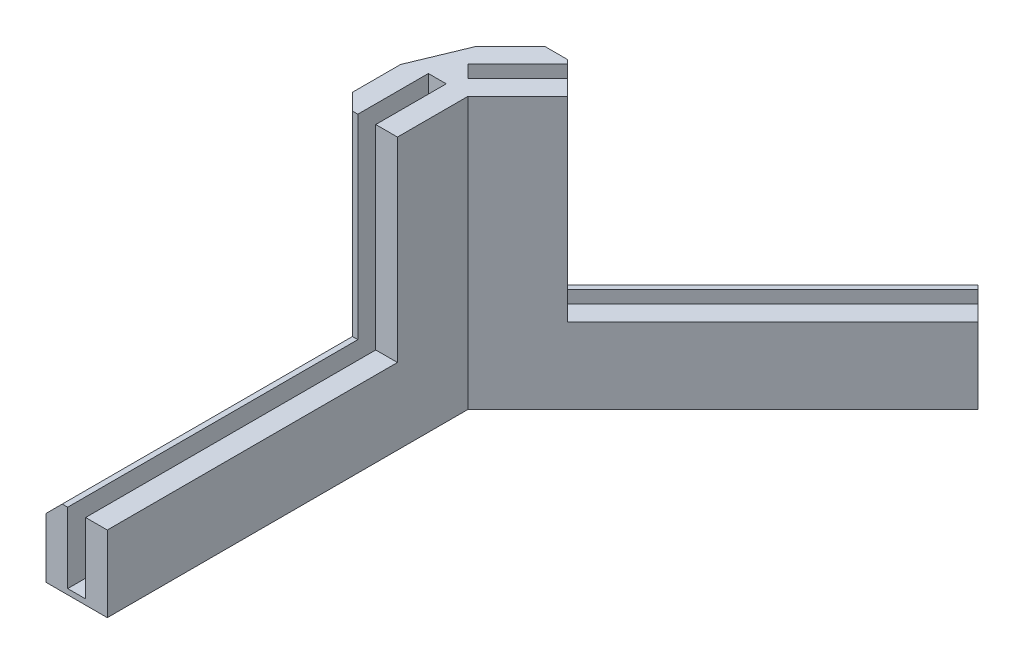
ISO-10303-21;
HEADER;
FILE_DESCRIPTION(('STEP AP214'),'2;1');
FILE_NAME('part.step','',(''),(''),'','','');
FILE_SCHEMA(('AUTOMOTIVE_DESIGN { 1 0 10303 214 1 1 1 1 }'));
ENDSEC;
DATA;
#1=APPLICATION_CONTEXT('core data for automotive mechanical design processes');
#2=APPLICATION_PROTOCOL_DEFINITION('international standard','automotive_design',2000,#1);
#3=PRODUCT_CONTEXT('',#1,'mechanical');
#4=PRODUCT('Part','Part','',(#3));
#5=PRODUCT_RELATED_PRODUCT_CATEGORY('part','',(#4));
#6=PRODUCT_DEFINITION_FORMATION('','',#4);
#7=PRODUCT_DEFINITION_CONTEXT('part definition',#1,'design');
#8=PRODUCT_DEFINITION('design','',#6,#7);
#9=PRODUCT_DEFINITION_SHAPE('','',#8);
#10=(LENGTH_UNIT() NAMED_UNIT(*) SI_UNIT(.MILLI.,.METRE.));
#11=(NAMED_UNIT(*) PLANE_ANGLE_UNIT() SI_UNIT($,.RADIAN.));
#12=(NAMED_UNIT(*) SI_UNIT($,.STERADIAN.) SOLID_ANGLE_UNIT());
#13=UNCERTAINTY_MEASURE_WITH_UNIT(LENGTH_MEASURE(1.E-05),#10,'distance_accuracy_value','');
#14=(GEOMETRIC_REPRESENTATION_CONTEXT(3) GLOBAL_UNCERTAINTY_ASSIGNED_CONTEXT((#13)) GLOBAL_UNIT_ASSIGNED_CONTEXT((#10,
#11,#12)) REPRESENTATION_CONTEXT('',''));
#15=CARTESIAN_POINT('',(0.,0.,0.));
#16=DIRECTION('',(0.,0.,1.));
#17=DIRECTION('',(1.,0.,0.));
#18=AXIS2_PLACEMENT_3D('',#15,#16,#17);
#19=CARTESIAN_POINT('',(-13.,50.,3.11837383565331));
#20=DIRECTION('',(0.923879869163213,0.,0.382682619614433));
#21=DIRECTION('',(0.,-1.,0.));
#22=AXIS2_PLACEMENT_3D('',#19,#20,#21);
#23=PLANE('',#22);
#24=DIRECTION('',(0.,-1.,0.));
#25=VECTOR('',#24,1.);
#26=CARTESIAN_POINT('',(-13.,50.,3.11837383565331));
#27=LINE('',#26,#25);
#28=CARTESIAN_POINT('',(-13.,50.,3.11837383565332));
#29=VERTEX_POINT('',#28);
#30=CARTESIAN_POINT('',(-13.,0.,3.11837383565332));
#31=VERTEX_POINT('',#30);
#32=EDGE_CURVE('E384',#29,#31,#27,.T.);
#33=ORIENTED_EDGE('',*,*,#32,.F.);
#34=DIRECTION('',(0.382682619614433,0.,-0.923879869163213));
#35=VECTOR('',#34,1.);
#36=CARTESIAN_POINT('',(-13.,50.,3.11837383565331));
#37=LINE('',#36,#35);
#38=CARTESIAN_POINT('',(-8.89951235406099,50.,-6.78110368347837));
#39=VERTEX_POINT('',#38);
#40=EDGE_CURVE('E389',#39,#29,#37,.F.);
#41=ORIENTED_EDGE('',*,*,#40,.F.);
#42=DIRECTION('',(0.,1.,0.));
#43=VECTOR('',#42,1.);
#44=CARTESIAN_POINT('',(-8.89951235406099,50.,-6.78110368347838));
#45=LINE('',#44,#43);
#46=CARTESIAN_POINT('',(-8.89951235406099,0.,-6.78110368347837));
#47=VERTEX_POINT('',#46);
#48=EDGE_CURVE('E387',#47,#39,#45,.T.);
#49=ORIENTED_EDGE('',*,*,#48,.F.);
#50=DIRECTION('',(-0.382682619614433,0.,0.923879869163213));
#51=VECTOR('',#50,1.);
#52=CARTESIAN_POINT('',(-9.99369246144622,0.,-4.13951265572129));
#53=LINE('',#52,#51);
#54=EDGE_CURVE('E227',#31,#47,#53,.F.);
#55=ORIENTED_EDGE('',*,*,#54,.F.);
#56=EDGE_LOOP('',(#33,#41,#49,#55));
#57=FACE_BOUND('',#56,.T.);
#58=ADVANCED_FACE('F40',(#57),#23,.F.);
#59=CARTESIAN_POINT('',(-1.7,50.,15.));
#60=DIRECTION('',(0.,0.,-1.));
#61=DIRECTION('',(-1.,0.,0.));
#62=AXIS2_PLACEMENT_3D('',#59,#60,#61);
#63=PLANE('',#62);
#64=DIRECTION('',(1.,0.,0.));
#65=VECTOR('',#64,1.);
#66=CARTESIAN_POINT('',(-9.,50.,15.));
#67=LINE('',#66,#65);
#68=CARTESIAN_POINT('',(-10.0000000000001,50.,15.));
#69=VERTEX_POINT('',#68);
#70=CARTESIAN_POINT('',(-9.,50.,15.));
#71=VERTEX_POINT('',#70);
#72=EDGE_CURVE('E354',#69,#71,#67,.T.);
#73=ORIENTED_EDGE('',*,*,#72,.F.);
#74=DIRECTION('',(0.,-1.,0.));
#75=VECTOR('',#74,1.);
#76=CARTESIAN_POINT('',(-10.0000000000001,50.,15.));
#77=LINE('',#76,#75);
#78=CARTESIAN_POINT('',(-10.0000000000001,14.,15.));
#79=VERTEX_POINT('',#78);
#80=EDGE_CURVE('E392',#69,#79,#77,.T.);
#81=ORIENTED_EDGE('',*,*,#80,.T.);
#82=DIRECTION('',(-1.,0.,0.));
#83=VECTOR('',#82,1.);
#84=CARTESIAN_POINT('',(-13.0000000000001,14.,15.));
#85=LINE('',#84,#83);
#86=CARTESIAN_POINT('',(-9.,14.,15.));
#87=VERTEX_POINT('',#86);
#88=EDGE_CURVE('E311',#87,#79,#85,.T.);
#89=ORIENTED_EDGE('',*,*,#88,.F.);
#90=DIRECTION('',(0.,-1.,0.));
#91=VECTOR('',#90,1.);
#92=CARTESIAN_POINT('',(-9.,50.,15.));
#93=LINE('',#92,#91);
#94=EDGE_CURVE('E381',#71,#87,#93,.T.);
#95=ORIENTED_EDGE('',*,*,#94,.F.);
#96=EDGE_LOOP('',(#73,#81,#89,#95));
#97=FACE_BOUND('',#96,.T.);
#98=ADVANCED_FACE('F509',(#97),#63,.F.);
#99=DIRECTION('',(-1.,0.,0.));
#100=VECTOR('',#99,1.);
#101=CARTESIAN_POINT('',(-5.70000000000014,14.,15.));
#102=LINE('',#101,#100);
#103=CARTESIAN_POINT('',(-1.7,14.,15.));
#104=VERTEX_POINT('',#103);
#105=CARTESIAN_POINT('',(-5.70000000000014,14.,15.));
#106=VERTEX_POINT('',#105);
#107=EDGE_CURVE('E307',#104,#106,#102,.T.);
#108=ORIENTED_EDGE('',*,*,#107,.F.);
#109=DIRECTION('',(0.,-1.,0.));
#110=VECTOR('',#109,1.);
#111=CARTESIAN_POINT('',(-1.7,50.,15.));
#112=LINE('',#111,#110);
#113=CARTESIAN_POINT('',(-1.7,50.,15.));
#114=VERTEX_POINT('',#113);
#115=EDGE_CURVE('E367',#114,#104,#112,.T.);
#116=ORIENTED_EDGE('',*,*,#115,.F.);
#117=DIRECTION('',(1.,0.,0.));
#118=VECTOR('',#117,1.);
#119=CARTESIAN_POINT('',(-1.7,50.,15.));
#120=LINE('',#119,#118);
#121=CARTESIAN_POINT('',(-5.7,50.,15.));
#122=VERTEX_POINT('',#121);
#123=EDGE_CURVE('E363',#122,#114,#120,.T.);
#124=ORIENTED_EDGE('',*,*,#123,.F.);
#125=DIRECTION('',(0.,-1.,0.));
#126=VECTOR('',#125,1.);
#127=CARTESIAN_POINT('',(-5.7,50.,15.));
#128=LINE('',#127,#126);
#129=EDGE_CURVE('E373',#122,#106,#128,.T.);
#130=ORIENTED_EDGE('',*,*,#129,.T.);
#131=EDGE_LOOP('',(#108,#116,#124,#130));
#132=FACE_BOUND('',#131,.T.);
#133=ADVANCED_FACE('F511',(#132),#63,.F.);
#134=CARTESIAN_POINT('',(-9.00000000000004,50.,1.99999999999999));
#135=DIRECTION('',(-1.,0.,0.));
#136=DIRECTION('',(0.,0.,1.));
#137=AXIS2_PLACEMENT_3D('',#134,#135,#136);
#138=PLANE('',#137);
#139=DIRECTION('',(0.,0.,-1.));
#140=VECTOR('',#139,1.);
#141=CARTESIAN_POINT('',(-9.00000000000004,1.,15.));
#142=LINE('',#141,#140);
#143=CARTESIAN_POINT('',(-9.,1.,68.5));
#144=VERTEX_POINT('',#143);
#145=CARTESIAN_POINT('',(-9.00000000000004,1.,1.99999999999999));
#146=VERTEX_POINT('',#145);
#147=EDGE_CURVE('E345',#144,#146,#142,.T.);
#148=ORIENTED_EDGE('',*,*,#147,.T.);
#149=DIRECTION('',(0.,-1.,0.));
#150=VECTOR('',#149,1.);
#151=CARTESIAN_POINT('',(-9.00000000000004,50.,1.99999999999999));
#152=LINE('',#151,#150);
#153=CARTESIAN_POINT('',(-9.00000000000004,50.,1.99999999999999));
#154=VERTEX_POINT('',#153);
#155=EDGE_CURVE('E378',#154,#146,#152,.T.);
#156=ORIENTED_EDGE('',*,*,#155,.F.);
#157=DIRECTION('',(0.,0.,-1.));
#158=VECTOR('',#157,1.);
#159=CARTESIAN_POINT('',(-9.00000000000004,50.,1.99999999999999));
#160=LINE('',#159,#158);
#161=EDGE_CURVE('E357',#71,#154,#160,.T.);
#162=ORIENTED_EDGE('',*,*,#161,.F.);
#163=ORIENTED_EDGE('',*,*,#94,.T.);
#164=DIRECTION('',(0.,0.,-1.));
#165=VECTOR('',#164,1.);
#166=CARTESIAN_POINT('',(-9.00000000000013,14.,68.5));
#167=LINE('',#166,#165);
#168=CARTESIAN_POINT('',(-9.00000000000013,14.,68.5));
#169=VERTEX_POINT('',#168);
#170=EDGE_CURVE('E329',#169,#87,#167,.T.);
#171=ORIENTED_EDGE('',*,*,#170,.F.);
#172=DIRECTION('',(0.,1.,0.));
#173=VECTOR('',#172,1.);
#174=CARTESIAN_POINT('',(-9.,1.,68.5));
#175=LINE('',#174,#173);
#176=EDGE_CURVE('E324',#144,#169,#175,.T.);
#177=ORIENTED_EDGE('',*,*,#176,.F.);
#178=EDGE_LOOP('',(#148,#156,#162,#163,#171,#177));
#179=FACE_BOUND('',#178,.T.);
#180=ADVANCED_FACE('F485',(#179),#138,.F.);
#181=CARTESIAN_POINT('',(-5.7,50.,1.99999999999999));
#182=DIRECTION('',(0.,0.,-1.));
#183=DIRECTION('',(-1.,0.,0.));
#184=AXIS2_PLACEMENT_3D('',#181,#182,#183);
#185=PLANE('',#184);
#186=DIRECTION('',(-1.,0.,0.));
#187=VECTOR('',#186,1.);
#188=CARTESIAN_POINT('',(-5.7,1.,1.99999999999998));
#189=LINE('',#188,#187);
#190=CARTESIAN_POINT('',(-5.7,1.,1.99999999999999));
#191=VERTEX_POINT('',#190);
#192=EDGE_CURVE('E342',#191,#146,#189,.T.);
#193=ORIENTED_EDGE('',*,*,#192,.F.);
#194=DIRECTION('',(0.,-1.,0.));
#195=VECTOR('',#194,1.);
#196=CARTESIAN_POINT('',(-5.7,50.,1.99999999999999));
#197=LINE('',#196,#195);
#198=CARTESIAN_POINT('',(-5.7,50.,1.99999999999999));
#199=VERTEX_POINT('',#198);
#200=EDGE_CURVE('E375',#199,#191,#197,.T.);
#201=ORIENTED_EDGE('',*,*,#200,.F.);
#202=DIRECTION('',(1.,0.,0.));
#203=VECTOR('',#202,1.);
#204=CARTESIAN_POINT('',(-5.7,50.,1.99999999999999));
#205=LINE('',#204,#203);
#206=EDGE_CURVE('E359',#154,#199,#205,.T.);
#207=ORIENTED_EDGE('',*,*,#206,.F.);
#208=ORIENTED_EDGE('',*,*,#155,.T.);
#209=EDGE_LOOP('',(#193,#201,#207,#208));
#210=FACE_BOUND('',#209,.T.);
#211=ADVANCED_FACE('F490',(#210),#185,.F.);
#212=CARTESIAN_POINT('',(-5.7,50.,15.));
#213=DIRECTION('',(1.,0.,0.));
#214=DIRECTION('',(0.,0.,-1.));
#215=AXIS2_PLACEMENT_3D('',#212,#213,#214);
#216=PLANE('',#215);
#217=DIRECTION('',(0.,0.,-1.));
#218=VECTOR('',#217,1.);
#219=CARTESIAN_POINT('',(-5.7,1.,15.));
#220=LINE('',#219,#218);
#221=CARTESIAN_POINT('',(-5.7,1.,68.5));
#222=VERTEX_POINT('',#221);
#223=EDGE_CURVE('E347',#222,#191,#220,.T.);
#224=ORIENTED_EDGE('',*,*,#223,.F.);
#225=DIRECTION('',(0.,-1.,0.));
#226=VECTOR('',#225,1.);
#227=CARTESIAN_POINT('',(-5.7,1.,68.5));
#228=LINE('',#227,#226);
#229=CARTESIAN_POINT('',(-5.70000000000014,14.,68.5));
#230=VERTEX_POINT('',#229);
#231=EDGE_CURVE('E318',#230,#222,#228,.T.);
#232=ORIENTED_EDGE('',*,*,#231,.F.);
#233=DIRECTION('',(0.,0.,-1.));
#234=VECTOR('',#233,1.);
#235=CARTESIAN_POINT('',(-5.70000000000014,14.,68.5));
#236=LINE('',#235,#234);
#237=EDGE_CURVE('E336',#230,#106,#236,.T.);
#238=ORIENTED_EDGE('',*,*,#237,.T.);
#239=ORIENTED_EDGE('',*,*,#129,.F.);
#240=DIRECTION('',(0.,0.,1.));
#241=VECTOR('',#240,1.);
#242=CARTESIAN_POINT('',(-5.7,50.,15.));
#243=LINE('',#242,#241);
#244=EDGE_CURVE('E361',#199,#122,#243,.T.);
#245=ORIENTED_EDGE('',*,*,#244,.F.);
#246=ORIENTED_EDGE('',*,*,#200,.T.);
#247=EDGE_LOOP('',(#224,#232,#238,#239,#245,#246));
#248=FACE_BOUND('',#247,.T.);
#249=ADVANCED_FACE('F523',(#248),#216,.F.);
#250=CARTESIAN_POINT('',(-13.,50.,15.));
#251=DIRECTION('',(1.,0.,0.));
#252=DIRECTION('',(0.,0.,-1.));
#253=AXIS2_PLACEMENT_3D('',#250,#251,#252);
#254=PLANE('',#253);
#255=DIRECTION('',(0.,0.,-1.));
#256=VECTOR('',#255,1.);
#257=CARTESIAN_POINT('',(-13.,11.0000000000001,15.));
#258=LINE('',#257,#256);
#259=CARTESIAN_POINT('',(-13.0000000000001,11.0000000000001,68.5));
#260=VERTEX_POINT('',#259);
#261=CARTESIAN_POINT('',(-13.,11.0000000000001,12.0000000000001));
#262=VERTEX_POINT('',#261);
#263=EDGE_CURVE('E395',#260,#262,#258,.T.);
#264=ORIENTED_EDGE('',*,*,#263,.T.);
#265=DIRECTION('',(0.,1.,0.));
#266=VECTOR('',#265,1.);
#267=CARTESIAN_POINT('',(-13.,50.,12.0000000000001));
#268=LINE('',#267,#266);
#269=CARTESIAN_POINT('',(-13.,50.,12.0000000000001));
#270=VERTEX_POINT('',#269);
#271=EDGE_CURVE('E397',#262,#270,#268,.T.);
#272=ORIENTED_EDGE('',*,*,#271,.T.);
#273=DIRECTION('',(0.,0.,1.));
#274=VECTOR('',#273,1.);
#275=CARTESIAN_POINT('',(-13.,50.,15.));
#276=LINE('',#275,#274);
#277=EDGE_CURVE('E351',#29,#270,#276,.T.);
#278=ORIENTED_EDGE('',*,*,#277,.F.);
#279=ORIENTED_EDGE('',*,*,#32,.T.);
#280=DIRECTION('',(0.,0.,1.));
#281=VECTOR('',#280,1.);
#282=CARTESIAN_POINT('',(-13.,0.,15.));
#283=LINE('',#282,#281);
#284=CARTESIAN_POINT('',(-13.,0.,68.5));
#285=VERTEX_POINT('',#284);
#286=EDGE_CURVE('E350',#31,#285,#283,.T.);
#287=ORIENTED_EDGE('',*,*,#286,.T.);
#288=DIRECTION('',(0.,-1.,0.));
#289=VECTOR('',#288,1.);
#290=CARTESIAN_POINT('',(-13.,0.,68.5));
#291=LINE('',#290,#289);
#292=EDGE_CURVE('E308',#260,#285,#291,.T.);
#293=ORIENTED_EDGE('',*,*,#292,.F.);
#294=EDGE_LOOP('',(#264,#272,#278,#279,#287,#293));
#295=FACE_BOUND('',#294,.T.);
#296=ADVANCED_FACE('F505',(#295),#254,.F.);
#297=CARTESIAN_POINT('',(-1.7,50.,1.99999999999999));
#298=DIRECTION('',(-1.,0.,0.));
#299=DIRECTION('',(0.,0.,1.));
#300=AXIS2_PLACEMENT_3D('',#297,#298,#299);
#301=PLANE('',#300);
#302=DIRECTION('',(0.,0.,-1.));
#303=VECTOR('',#302,1.);
#304=CARTESIAN_POINT('',(-1.7,0.,1.99999999999999));
#305=LINE('',#304,#303);
#306=CARTESIAN_POINT('',(-1.7,0.,68.5));
#307=VERTEX_POINT('',#306);
#308=CARTESIAN_POINT('',(-1.7,0.,1.99999999999999));
#309=VERTEX_POINT('',#308);
#310=EDGE_CURVE('E355',#307,#309,#305,.T.);
#311=ORIENTED_EDGE('',*,*,#310,.T.);
#312=DIRECTION('',(0.,-1.,0.));
#313=VECTOR('',#312,1.);
#314=CARTESIAN_POINT('',(-1.7,50.,1.99999999999999));
#315=LINE('',#314,#313);
#316=CARTESIAN_POINT('',(-1.7,50.,1.99999999999999));
#317=VERTEX_POINT('',#316);
#318=EDGE_CURVE('E287',#317,#309,#315,.T.);
#319=ORIENTED_EDGE('',*,*,#318,.F.);
#320=DIRECTION('',(0.,0.,-1.));
#321=VECTOR('',#320,1.);
#322=CARTESIAN_POINT('',(-1.7,50.,1.99999999999999));
#323=LINE('',#322,#321);
#324=EDGE_CURVE('E365',#114,#317,#323,.T.);
#325=ORIENTED_EDGE('',*,*,#324,.F.);
#326=ORIENTED_EDGE('',*,*,#115,.T.);
#327=DIRECTION('',(0.,0.,-1.));
#328=VECTOR('',#327,1.);
#329=CARTESIAN_POINT('',(-1.70000000000015,14.,68.5));
#330=LINE('',#329,#328);
#331=CARTESIAN_POINT('',(-1.70000000000015,14.,68.5));
#332=VERTEX_POINT('',#331);
#333=EDGE_CURVE('E339',#332,#104,#330,.T.);
#334=ORIENTED_EDGE('',*,*,#333,.F.);
#335=DIRECTION('',(0.,1.,0.));
#336=VECTOR('',#335,1.);
#337=CARTESIAN_POINT('',(-1.7,0.,68.5));
#338=LINE('',#337,#336);
#339=EDGE_CURVE('E314',#307,#332,#338,.T.);
#340=ORIENTED_EDGE('',*,*,#339,.F.);
#341=EDGE_LOOP('',(#311,#319,#325,#326,#334,#340));
#342=FACE_BOUND('',#341,.T.);
#343=ADVANCED_FACE('F470',(#342),#301,.F.);
#344=CARTESIAN_POINT('',(0.,50.,0.));
#345=DIRECTION('',(0.,-1.,0.));
#346=DIRECTION('',(0.,0.,-1.));
#347=AXIS2_PLACEMENT_3D('',#344,#345,#346);
#348=PLANE('',#347);
#349=ORIENTED_EDGE('',*,*,#277,.T.);
#350=DIRECTION('',(-0.707106781186549,0.,-0.707106781186546));
#351=VECTOR('',#350,1.);
#352=CARTESIAN_POINT('',(-10.0000000000001,50.,15.));
#353=LINE('',#352,#351);
#354=EDGE_CURVE('E401',#270,#69,#353,.F.);
#355=ORIENTED_EDGE('',*,*,#354,.T.);
#356=ORIENTED_EDGE('',*,*,#72,.T.);
#357=ORIENTED_EDGE('',*,*,#161,.T.);
#358=ORIENTED_EDGE('',*,*,#206,.T.);
#359=ORIENTED_EDGE('',*,*,#244,.T.);
#360=ORIENTED_EDGE('',*,*,#123,.T.);
#361=ORIENTED_EDGE('',*,*,#324,.T.);
#362=DIRECTION('',(-0.707105537080835,0.,0.707108025290071));
#363=VECTOR('',#362,1.);
#364=CARTESIAN_POINT('',(-1.7,50.,1.99999999999999));
#365=LINE('',#364,#363);
#366=CARTESIAN_POINT('',(7.49237198205085,50.,-7.19240432877094));
#367=VERTEX_POINT('',#366);
#368=EDGE_CURVE('E285',#367,#317,#365,.T.);
#369=ORIENTED_EDGE('',*,*,#368,.F.);
#370=DIRECTION('',(0.707108025290071,0.,0.707105537080835));
#371=VECTOR('',#370,1.);
#372=CARTESIAN_POINT('',(7.49237198205085,50.,-7.19240432877094));
#373=LINE('',#372,#371);
#374=CARTESIAN_POINT('',(4.66393988089057,50.,-10.0208264770943));
#375=VERTEX_POINT('',#374);
#376=EDGE_CURVE('E282',#375,#367,#373,.T.);
#377=ORIENTED_EDGE('',*,*,#376,.F.);
#378=DIRECTION('',(0.707105537080835,0.,-0.707108025290071));
#379=VECTOR('',#378,1.);
#380=CARTESIAN_POINT('',(4.66393988089057,50.,-10.0208264770943));
#381=LINE('',#380,#379);
#382=CARTESIAN_POINT('',(-4.52843210116029,50.,-0.828422148323351));
#383=VERTEX_POINT('',#382);
#384=EDGE_CURVE('E280',#383,#375,#381,.T.);
#385=ORIENTED_EDGE('',*,*,#384,.F.);
#386=DIRECTION('',(0.707108025290071,0.,0.707105537080835));
#387=VECTOR('',#386,1.);
#388=CARTESIAN_POINT('',(-4.52843210116029,50.,-0.828422148323351));
#389=LINE('',#388,#387);
#390=CARTESIAN_POINT('',(-6.86188858461755,50.,-3.16187042069014));
#391=VERTEX_POINT('',#390);
#392=EDGE_CURVE('E277',#391,#383,#389,.T.);
#393=ORIENTED_EDGE('',*,*,#392,.F.);
#394=DIRECTION('',(-0.707105537080837,0.,0.707108025290069));
#395=VECTOR('',#394,1.);
#396=CARTESIAN_POINT('',(-6.86188858461755,50.,-3.16187042069014));
#397=LINE('',#396,#395);
#398=CARTESIAN_POINT('',(2.33048339743333,50.,-12.354274749461));
#399=VERTEX_POINT('',#398);
#400=EDGE_CURVE('E274',#399,#391,#397,.T.);
#401=ORIENTED_EDGE('',*,*,#400,.F.);
#402=DIRECTION('',(0.707108025290071,0.,0.707105537080835));
#403=VECTOR('',#402,1.);
#404=CARTESIAN_POINT('',(2.33048339743333,50.,-12.354274749461));
#405=LINE('',#404,#403);
#406=CARTESIAN_POINT('',(1.62337537214327,50.,-13.0613802865419));
#407=VERTEX_POINT('',#406);
#408=EDGE_CURVE('E272',#407,#399,#405,.T.);
#409=ORIENTED_EDGE('',*,*,#408,.F.);
#410=DIRECTION('',(0.999999999998452,0.,-1.7594296216528E-06));
#411=VECTOR('',#410,1.);
#412=CARTESIAN_POINT('',(-2.61926531496945,50.,-13.0613728219142));
#413=LINE('',#412,#411);
#414=CARTESIAN_POINT('',(-2.61926531496945,50.,-13.0613728219142));
#415=VERTEX_POINT('',#414);
#416=EDGE_CURVE('E399',#407,#415,#413,.F.);
#417=ORIENTED_EDGE('',*,*,#416,.T.);
#418=DIRECTION('',(0.707105537080835,0.,-0.707108025290071));
#419=VECTOR('',#418,1.);
#420=CARTESIAN_POINT('',(-0.497948703726949,50.,-15.1826968977844));
#421=LINE('',#420,#419);
#422=EDGE_CURVE('E270',#39,#415,#421,.T.);
#423=ORIENTED_EDGE('',*,*,#422,.F.);
#424=ORIENTED_EDGE('',*,*,#40,.T.);
#425=EDGE_LOOP('',(#349,#355,#356,#357,#358,#359,#360,#361,#369,#377,#385,#393,#401,#409,#417,
#423,#424));
#426=FACE_BOUND('',#425,.T.);
#427=ADVANCED_FACE('F452',(#426),#348,.F.);
#428=CARTESIAN_POINT('',(0.,0.,0.));
#429=DIRECTION('',(0.,-1.,0.));
#430=DIRECTION('',(0.,0.,-1.));
#431=AXIS2_PLACEMENT_3D('',#428,#429,#430);
#432=PLANE('',#431);
#433=ORIENTED_EDGE('',*,*,#286,.F.);
#434=ORIENTED_EDGE('',*,*,#54,.T.);
#435=DIRECTION('',(0.707105537080835,0.,-0.707108025290071));
#436=VECTOR('',#435,1.);
#437=CARTESIAN_POINT('',(-0.497948703726949,0.,-15.1826968977844));
#438=LINE('',#437,#436);
#439=CARTESIAN_POINT('',(37.3321975300977,0.,-53.0129762508032));
#440=VERTEX_POINT('',#439);
#441=EDGE_CURVE('E215',#47,#440,#438,.T.);
#442=ORIENTED_EDGE('',*,*,#441,.T.);
#443=DIRECTION('',(0.707108025290071,0.,0.707105537080835));
#444=VECTOR('',#443,1.);
#445=CARTESIAN_POINT('',(37.3321975300977,0.,-53.0129762508032));
#446=LINE('',#445,#444);
#447=CARTESIAN_POINT('',(45.3225182158755,0.,-45.0226836817897));
#448=VERTEX_POINT('',#447);
#449=EDGE_CURVE('E219',#440,#448,#446,.T.);
#450=ORIENTED_EDGE('',*,*,#449,.T.);
#451=DIRECTION('',(-0.707105537080835,0.,0.707108025290071));
#452=VECTOR('',#451,1.);
#453=CARTESIAN_POINT('',(-1.7,0.,1.99999999999999));
#454=LINE('',#453,#452);
#455=EDGE_CURVE('E229',#448,#309,#454,.T.);
#456=ORIENTED_EDGE('',*,*,#455,.T.);
#457=ORIENTED_EDGE('',*,*,#310,.F.);
#458=DIRECTION('',(1.,0.,0.));
#459=VECTOR('',#458,1.);
#460=CARTESIAN_POINT('',(-13.,0.,68.5));
#461=LINE('',#460,#459);
#462=EDGE_CURVE('E310',#285,#307,#461,.T.);
#463=ORIENTED_EDGE('',*,*,#462,.F.);
#464=EDGE_LOOP('',(#433,#434,#442,#450,#456,#457,#463));
#465=FACE_BOUND('',#464,.T.);
#466=ADVANCED_FACE('F224',(#465),#432,.T.);
#467=CARTESIAN_POINT('',(-5.7,1.,15.));
#468=DIRECTION('',(0.,-1.,0.));
#469=DIRECTION('',(0.,0.,-1.));
#470=AXIS2_PLACEMENT_3D('',#467,#468,#469);
#471=PLANE('',#470);
#472=ORIENTED_EDGE('',*,*,#192,.T.);
#473=ORIENTED_EDGE('',*,*,#147,.F.);
#474=DIRECTION('',(-1.,0.,0.));
#475=VECTOR('',#474,1.);
#476=CARTESIAN_POINT('',(-9.,1.,68.5));
#477=LINE('',#476,#475);
#478=EDGE_CURVE('E321',#222,#144,#477,.T.);
#479=ORIENTED_EDGE('',*,*,#478,.F.);
#480=ORIENTED_EDGE('',*,*,#223,.T.);
#481=EDGE_LOOP('',(#472,#473,#479,#480));
#482=FACE_BOUND('',#481,.T.);
#483=ADVANCED_FACE('F482',(#482),#471,.F.);
#484=CARTESIAN_POINT('',(-5.70000000000014,14.,68.5));
#485=DIRECTION('',(0.,-1.,0.));
#486=DIRECTION('',(0.,0.,-1.));
#487=AXIS2_PLACEMENT_3D('',#484,#485,#486);
#488=PLANE('',#487);
#489=ORIENTED_EDGE('',*,*,#107,.T.);
#490=ORIENTED_EDGE('',*,*,#237,.F.);
#491=DIRECTION('',(-1.,0.,0.));
#492=VECTOR('',#491,1.);
#493=CARTESIAN_POINT('',(-5.70000000000014,14.,68.5));
#494=LINE('',#493,#492);
#495=EDGE_CURVE('E316',#332,#230,#494,.T.);
#496=ORIENTED_EDGE('',*,*,#495,.F.);
#497=ORIENTED_EDGE('',*,*,#333,.T.);
#498=EDGE_LOOP('',(#489,#490,#496,#497));
#499=FACE_BOUND('',#498,.T.);
#500=ADVANCED_FACE('F476',(#499),#488,.F.);
#501=CARTESIAN_POINT('',(-13.0000000000001,14.,68.5));
#502=DIRECTION('',(0.,-1.,0.));
#503=DIRECTION('',(0.,0.,-1.));
#504=AXIS2_PLACEMENT_3D('',#501,#502,#503);
#505=PLANE('',#504);
#506=ORIENTED_EDGE('',*,*,#88,.T.);
#507=DIRECTION('',(0.,0.,1.));
#508=VECTOR('',#507,1.);
#509=CARTESIAN_POINT('',(-10.0000000000001,14.,68.5));
#510=LINE('',#509,#508);
#511=CARTESIAN_POINT('',(-10.0000000000001,14.,68.5));
#512=VERTEX_POINT('',#511);
#513=EDGE_CURVE('E403',#79,#512,#510,.T.);
#514=ORIENTED_EDGE('',*,*,#513,.T.);
#515=DIRECTION('',(-1.,0.,0.));
#516=VECTOR('',#515,1.);
#517=CARTESIAN_POINT('',(-13.0000000000001,14.,68.5));
#518=LINE('',#517,#516);
#519=EDGE_CURVE('E326',#169,#512,#518,.T.);
#520=ORIENTED_EDGE('',*,*,#519,.F.);
#521=ORIENTED_EDGE('',*,*,#170,.T.);
#522=EDGE_LOOP('',(#506,#514,#520,#521));
#523=FACE_BOUND('',#522,.T.);
#524=ADVANCED_FACE('F499',(#523),#505,.F.);
#525=CARTESIAN_POINT('',(0.,0.,68.5));
#526=DIRECTION('',(0.,0.,-1.));
#527=DIRECTION('',(-1.,0.,0.));
#528=AXIS2_PLACEMENT_3D('',#525,#526,#527);
#529=PLANE('',#528);
#530=ORIENTED_EDGE('',*,*,#519,.T.);
#531=DIRECTION('',(0.707106781186549,0.707106781186546,0.));
#532=VECTOR('',#531,1.);
#533=CARTESIAN_POINT('',(-13.,11.0000000000001,68.5));
#534=LINE('',#533,#532);
#535=EDGE_CURVE('E405',#512,#260,#534,.F.);
#536=ORIENTED_EDGE('',*,*,#535,.T.);
#537=ORIENTED_EDGE('',*,*,#292,.T.);
#538=ORIENTED_EDGE('',*,*,#462,.T.);
#539=ORIENTED_EDGE('',*,*,#339,.T.);
#540=ORIENTED_EDGE('',*,*,#495,.T.);
#541=ORIENTED_EDGE('',*,*,#231,.T.);
#542=ORIENTED_EDGE('',*,*,#478,.T.);
#543=ORIENTED_EDGE('',*,*,#176,.T.);
#544=EDGE_LOOP('',(#530,#536,#537,#538,#539,#540,#541,#542,#543));
#545=FACE_BOUND('',#544,.T.);
#546=ADVANCED_FACE('F467',(#545),#529,.F.);
#547=CARTESIAN_POINT('',(7.49237198205085,50.,-7.19240432877094));
#548=DIRECTION('',(-0.707105537080835,0.,0.707108025290071));
#549=DIRECTION('',(-0.707108025290071,0.,-0.707105537080835));
#550=AXIS2_PLACEMENT_3D('',#547,#548,#549);
#551=PLANE('',#550);
#552=DIRECTION('',(-0.707108025290071,0.,-0.707105537080835));
#553=VECTOR('',#552,1.);
#554=CARTESIAN_POINT('',(-0.497948703727053,14.,-15.1826968977845));
#555=LINE('',#554,#553);
#556=CARTESIAN_POINT('',(2.33048339743333,14.,-12.354274749461));
#557=VERTEX_POINT('',#556);
#558=CARTESIAN_POINT('',(1.62337537214327,14.,-13.0613802865419));
#559=VERTEX_POINT('',#558);
#560=EDGE_CURVE('E220',#557,#559,#555,.T.);
#561=ORIENTED_EDGE('',*,*,#560,.T.);
#562=DIRECTION('',(0.,1.,0.));
#563=VECTOR('',#562,1.);
#564=CARTESIAN_POINT('',(1.62337537214327,50.,-13.0613802865419));
#565=LINE('',#564,#563);
#566=EDGE_CURVE('E13',#559,#407,#565,.T.);
#567=ORIENTED_EDGE('',*,*,#566,.T.);
#568=ORIENTED_EDGE('',*,*,#408,.T.);
#569=DIRECTION('',(0.,-1.,0.));
#570=VECTOR('',#569,1.);
#571=CARTESIAN_POINT('',(2.33048339743333,50.,-12.354274749461));
#572=LINE('',#571,#570);
#573=EDGE_CURVE('E304',#399,#557,#572,.T.);
#574=ORIENTED_EDGE('',*,*,#573,.T.);
#575=EDGE_LOOP('',(#561,#567,#568,#574));
#576=FACE_BOUND('',#575,.T.);
#577=ADVANCED_FACE('F430',(#576),#551,.F.);
#578=DIRECTION('',(-0.707108025290071,0.,-0.707105537080835));
#579=VECTOR('',#578,1.);
#580=CARTESIAN_POINT('',(4.66393988089047,14.,-10.0208264770944));
#581=LINE('',#580,#579);
#582=CARTESIAN_POINT('',(7.49237198205085,14.,-7.19240432877094));
#583=VERTEX_POINT('',#582);
#584=CARTESIAN_POINT('',(4.66393988089047,14.,-10.0208264770944));
#585=VERTEX_POINT('',#584);
#586=EDGE_CURVE('E253',#583,#585,#581,.T.);
#587=ORIENTED_EDGE('',*,*,#586,.T.);
#588=DIRECTION('',(0.,-1.,0.));
#589=VECTOR('',#588,1.);
#590=CARTESIAN_POINT('',(4.66393988089057,50.,-10.0208264770943));
#591=LINE('',#590,#589);
#592=EDGE_CURVE('E295',#375,#585,#591,.T.);
#593=ORIENTED_EDGE('',*,*,#592,.F.);
#594=ORIENTED_EDGE('',*,*,#376,.T.);
#595=DIRECTION('',(0.,-1.,0.));
#596=VECTOR('',#595,1.);
#597=CARTESIAN_POINT('',(7.49237198205085,50.,-7.19240432877094));
#598=LINE('',#597,#596);
#599=EDGE_CURVE('E292',#367,#583,#598,.T.);
#600=ORIENTED_EDGE('',*,*,#599,.T.);
#601=EDGE_LOOP('',(#587,#593,#594,#600));
#602=FACE_BOUND('',#601,.T.);
#603=ADVANCED_FACE('F455',(#602),#551,.F.);
#604=CARTESIAN_POINT('',(-6.86188858461755,50.,-3.16187042069014));
#605=DIRECTION('',(-0.707108025290068,0.,-0.707105537080838));
#606=DIRECTION('',(0.707105537080837,0.,-0.707108025290069));
#607=AXIS2_PLACEMENT_3D('',#604,#605,#606);
#608=PLANE('',#607);
#609=DIRECTION('',(-0.707105537080835,0.,0.707108025290071));
#610=VECTOR('',#609,1.);
#611=CARTESIAN_POINT('',(2.3304833974333,1.,-12.3542747494611));
#612=LINE('',#611,#610);
#613=CARTESIAN_POINT('',(40.160629631258,1.,-50.1845541024798));
#614=VERTEX_POINT('',#613);
#615=CARTESIAN_POINT('',(-6.86188858461755,1.,-3.16187042069014));
#616=VERTEX_POINT('',#615);
#617=EDGE_CURVE('E266',#614,#616,#612,.T.);
#618=ORIENTED_EDGE('',*,*,#617,.F.);
#619=DIRECTION('',(0.,1.,0.));
#620=VECTOR('',#619,1.);
#621=CARTESIAN_POINT('',(40.160629631258,1.,-50.1845541024798));
#622=LINE('',#621,#620);
#623=CARTESIAN_POINT('',(40.1606296312579,14.,-50.1845541024799));
#624=VERTEX_POINT('',#623);
#625=EDGE_CURVE('E246',#614,#624,#622,.T.);
#626=ORIENTED_EDGE('',*,*,#625,.T.);
#627=DIRECTION('',(-0.707105537080835,0.,0.707108025290071));
#628=VECTOR('',#627,1.);
#629=CARTESIAN_POINT('',(40.1606296312579,14.,-50.1845541024799));
#630=LINE('',#629,#628);
#631=EDGE_CURVE('E252',#624,#557,#630,.T.);
#632=ORIENTED_EDGE('',*,*,#631,.T.);
#633=ORIENTED_EDGE('',*,*,#573,.F.);
#634=ORIENTED_EDGE('',*,*,#400,.T.);
#635=DIRECTION('',(0.,-1.,0.));
#636=VECTOR('',#635,1.);
#637=CARTESIAN_POINT('',(-6.86188858461755,50.,-3.16187042069014));
#638=LINE('',#637,#636);
#639=EDGE_CURVE('E301',#391,#616,#638,.T.);
#640=ORIENTED_EDGE('',*,*,#639,.T.);
#641=EDGE_LOOP('',(#618,#626,#632,#633,#634,#640));
#642=FACE_BOUND('',#641,.T.);
#643=ADVANCED_FACE('F435',(#642),#608,.F.);
#644=CARTESIAN_POINT('',(-4.52843210116029,50.,-0.828422148323351));
#645=DIRECTION('',(-0.707105537080835,0.,0.707108025290071));
#646=DIRECTION('',(-0.707108025290071,0.,-0.707105537080835));
#647=AXIS2_PLACEMENT_3D('',#644,#645,#646);
#648=PLANE('',#647);
#649=DIRECTION('',(-0.707108025290071,0.,-0.707105537080835));
#650=VECTOR('',#649,1.);
#651=CARTESIAN_POINT('',(-4.52843210116029,1.,-0.828422148323351));
#652=LINE('',#651,#650);
#653=CARTESIAN_POINT('',(-4.52843210116029,1.,-0.828422148323351));
#654=VERTEX_POINT('',#653);
#655=EDGE_CURVE('E264',#654,#616,#652,.T.);
#656=ORIENTED_EDGE('',*,*,#655,.T.);
#657=ORIENTED_EDGE('',*,*,#639,.F.);
#658=ORIENTED_EDGE('',*,*,#392,.T.);
#659=DIRECTION('',(0.,-1.,0.));
#660=VECTOR('',#659,1.);
#661=CARTESIAN_POINT('',(-4.52843210116029,50.,-0.828422148323351));
#662=LINE('',#661,#660);
#663=EDGE_CURVE('E298',#383,#654,#662,.T.);
#664=ORIENTED_EDGE('',*,*,#663,.T.);
#665=EDGE_LOOP('',(#656,#657,#658,#664));
#666=FACE_BOUND('',#665,.T.);
#667=ADVANCED_FACE('F448',(#666),#648,.F.);
#668=CARTESIAN_POINT('',(4.66393988089057,50.,-10.0208264770943));
#669=DIRECTION('',(0.707108025290071,0.,0.707105537080835));
#670=DIRECTION('',(-0.707105537080835,0.,0.707108025290071));
#671=AXIS2_PLACEMENT_3D('',#668,#669,#670);
#672=PLANE('',#671);
#673=DIRECTION('',(-0.707105537080835,0.,0.707108025290071));
#674=VECTOR('',#673,1.);
#675=CARTESIAN_POINT('',(4.66393988089057,1.,-10.0208264770943));
#676=LINE('',#675,#674);
#677=CARTESIAN_POINT('',(42.4940861147152,1.,-47.8511058301131));
#678=VERTEX_POINT('',#677);
#679=EDGE_CURVE('E230',#678,#654,#676,.T.);
#680=ORIENTED_EDGE('',*,*,#679,.T.);
#681=ORIENTED_EDGE('',*,*,#663,.F.);
#682=ORIENTED_EDGE('',*,*,#384,.T.);
#683=ORIENTED_EDGE('',*,*,#592,.T.);
#684=DIRECTION('',(-0.707105537080835,0.,0.707108025290071));
#685=VECTOR('',#684,1.);
#686=CARTESIAN_POINT('',(42.4940861147151,14.,-47.8511058301132));
#687=LINE('',#686,#685);
#688=CARTESIAN_POINT('',(42.4940861147151,14.,-47.8511058301132));
#689=VERTEX_POINT('',#688);
#690=EDGE_CURVE('E260',#689,#585,#687,.T.);
#691=ORIENTED_EDGE('',*,*,#690,.F.);
#692=DIRECTION('',(0.,-1.,0.));
#693=VECTOR('',#692,1.);
#694=CARTESIAN_POINT('',(42.4940861147152,1.,-47.8511058301131));
#695=LINE('',#694,#693);
#696=EDGE_CURVE('E241',#689,#678,#695,.T.);
#697=ORIENTED_EDGE('',*,*,#696,.T.);
#698=EDGE_LOOP('',(#680,#681,#682,#683,#691,#697));
#699=FACE_BOUND('',#698,.T.);
#700=ADVANCED_FACE('F442',(#699),#672,.F.);
#701=CARTESIAN_POINT('',(-0.497948703726949,50.,-15.1826968977844));
#702=DIRECTION('',(0.707108025290071,0.,0.707105537080835));
#703=DIRECTION('',(-0.707105537080835,0.,0.707108025290071));
#704=AXIS2_PLACEMENT_3D('',#701,#702,#703);
#705=PLANE('',#704);
#706=DIRECTION('',(0.,-1.,0.));
#707=VECTOR('',#706,1.);
#708=CARTESIAN_POINT('',(-2.61926531496945,50.,-13.0613728219142));
#709=LINE('',#708,#707);
#710=CARTESIAN_POINT('',(-2.61926531496945,11.,-13.0613728219142));
#711=VERTEX_POINT('',#710);
#712=EDGE_CURVE('E57',#415,#711,#709,.T.);
#713=ORIENTED_EDGE('',*,*,#712,.T.);
#714=DIRECTION('',(0.707105537080835,0.,-0.707108025290071));
#715=VECTOR('',#714,1.);
#716=CARTESIAN_POINT('',(-0.497948703726949,11.,-15.1826968977844));
#717=LINE('',#716,#715);
#718=CARTESIAN_POINT('',(37.3321975300976,11.,-53.0129762508033));
#719=VERTEX_POINT('',#718);
#720=EDGE_CURVE('E61',#711,#719,#717,.T.);
#721=ORIENTED_EDGE('',*,*,#720,.T.);
#722=DIRECTION('',(0.,-1.,0.));
#723=VECTOR('',#722,1.);
#724=CARTESIAN_POINT('',(37.3321975300977,0.,-53.0129762508032));
#725=LINE('',#724,#723);
#726=EDGE_CURVE('E211',#719,#440,#725,.T.);
#727=ORIENTED_EDGE('',*,*,#726,.T.);
#728=ORIENTED_EDGE('',*,*,#441,.F.);
#729=ORIENTED_EDGE('',*,*,#48,.T.);
#730=ORIENTED_EDGE('',*,*,#422,.T.);
#731=EDGE_LOOP('',(#713,#721,#727,#728,#729,#730));
#732=FACE_BOUND('',#731,.T.);
#733=ADVANCED_FACE('F213',(#732),#705,.F.);
#734=CARTESIAN_POINT('',(-1.7,50.,1.99999999999999));
#735=DIRECTION('',(-0.707108025290071,0.,-0.707105537080835));
#736=DIRECTION('',(0.707105537080835,0.,-0.707108025290071));
#737=AXIS2_PLACEMENT_3D('',#734,#735,#736);
#738=PLANE('',#737);
#739=ORIENTED_EDGE('',*,*,#455,.F.);
#740=DIRECTION('',(0.,1.,0.));
#741=VECTOR('',#740,1.);
#742=CARTESIAN_POINT('',(45.3225182158755,0.,-45.0226836817897));
#743=LINE('',#742,#741);
#744=CARTESIAN_POINT('',(45.3225182158754,14.,-45.0226836817898));
#745=VERTEX_POINT('',#744);
#746=EDGE_CURVE('E234',#448,#745,#743,.T.);
#747=ORIENTED_EDGE('',*,*,#746,.T.);
#748=DIRECTION('',(-0.707105537080835,0.,0.707108025290071));
#749=VECTOR('',#748,1.);
#750=CARTESIAN_POINT('',(45.3225182158754,14.,-45.0226836817898));
#751=LINE('',#750,#749);
#752=EDGE_CURVE('E262',#745,#583,#751,.T.);
#753=ORIENTED_EDGE('',*,*,#752,.T.);
#754=ORIENTED_EDGE('',*,*,#599,.F.);
#755=ORIENTED_EDGE('',*,*,#368,.T.);
#756=ORIENTED_EDGE('',*,*,#318,.T.);
#757=EDGE_LOOP('',(#739,#747,#753,#754,#755,#756));
#758=FACE_BOUND('',#757,.T.);
#759=ADVANCED_FACE('F461',(#758),#738,.F.);
#760=CARTESIAN_POINT('',(4.66393988089057,1.,-10.0208264770943));
#761=DIRECTION('',(0.,-1.,0.));
#762=DIRECTION('',(-0.707105537080835,0.,0.707108025290071));
#763=AXIS2_PLACEMENT_3D('',#760,#761,#762);
#764=PLANE('',#763);
#765=ORIENTED_EDGE('',*,*,#655,.F.);
#766=ORIENTED_EDGE('',*,*,#679,.F.);
#767=DIRECTION('',(-0.707108025290071,0.,-0.707105537080835));
#768=VECTOR('',#767,1.);
#769=CARTESIAN_POINT('',(40.160629631258,1.,-50.1845541024798));
#770=LINE('',#769,#768);
#771=EDGE_CURVE('E244',#678,#614,#770,.T.);
#772=ORIENTED_EDGE('',*,*,#771,.T.);
#773=ORIENTED_EDGE('',*,*,#617,.T.);
#774=EDGE_LOOP('',(#765,#766,#772,#773));
#775=FACE_BOUND('',#774,.T.);
#776=ADVANCED_FACE('F445',(#775),#764,.F.);
#777=CARTESIAN_POINT('',(42.4940861147151,14.,-47.8511058301132));
#778=DIRECTION('',(0.,-1.,0.));
#779=DIRECTION('',(-0.707105537080835,0.,0.707108025290071));
#780=AXIS2_PLACEMENT_3D('',#777,#778,#779);
#781=PLANE('',#780);
#782=ORIENTED_EDGE('',*,*,#586,.F.);
#783=ORIENTED_EDGE('',*,*,#752,.F.);
#784=DIRECTION('',(-0.707108025290071,0.,-0.707105537080835));
#785=VECTOR('',#784,1.);
#786=CARTESIAN_POINT('',(42.4940861147151,14.,-47.8511058301132));
#787=LINE('',#786,#785);
#788=EDGE_CURVE('E237',#745,#689,#787,.T.);
#789=ORIENTED_EDGE('',*,*,#788,.T.);
#790=ORIENTED_EDGE('',*,*,#690,.T.);
#791=EDGE_LOOP('',(#782,#783,#789,#790));
#792=FACE_BOUND('',#791,.T.);
#793=ADVANCED_FACE('F459',(#792),#781,.F.);
#794=CARTESIAN_POINT('',(37.3321975300976,14.,-53.0129762508033));
#795=DIRECTION('',(0.,-1.,0.));
#796=DIRECTION('',(-0.707105537080835,0.,0.707108025290071));
#797=AXIS2_PLACEMENT_3D('',#794,#795,#796);
#798=PLANE('',#797);
#799=DIRECTION('',(-0.707108025290071,0.,-0.707105537080835));
#800=VECTOR('',#799,1.);
#801=CARTESIAN_POINT('',(37.3321975300976,14.,-53.0129762508033));
#802=LINE('',#801,#800);
#803=CARTESIAN_POINT('',(39.4535216059679,14.,-50.8916596395607));
#804=VERTEX_POINT('',#803);
#805=EDGE_CURVE('E249',#624,#804,#802,.T.);
#806=ORIENTED_EDGE('',*,*,#805,.T.);
#807=DIRECTION('',(-0.707105537080835,0.,0.707108025290071));
#808=VECTOR('',#807,1.);
#809=CARTESIAN_POINT('',(39.4535216059679,14.,-50.8916596395607));
#810=LINE('',#809,#808);
#811=EDGE_CURVE('E407',#804,#559,#810,.T.);
#812=ORIENTED_EDGE('',*,*,#811,.T.);
#813=ORIENTED_EDGE('',*,*,#560,.F.);
#814=ORIENTED_EDGE('',*,*,#631,.F.);
#815=EDGE_LOOP('',(#806,#812,#813,#814));
#816=FACE_BOUND('',#815,.T.);
#817=ADVANCED_FACE('F428',(#816),#798,.F.);
#818=CARTESIAN_POINT('',(46.5246018588686,0.,-43.8206042687523));
#819=DIRECTION('',(-0.707105537080835,0.,0.707108025290071));
#820=DIRECTION('',(-0.707108025290071,0.,-0.707105537080835));
#821=AXIS2_PLACEMENT_3D('',#818,#819,#820);
#822=PLANE('',#821);
#823=ORIENTED_EDGE('',*,*,#726,.F.);
#824=DIRECTION('',(-0.500000879714039,-0.707106781186547,-0.499999120284415));
#825=VECTOR('',#824,1.);
#826=CARTESIAN_POINT('',(39.4535216059679,14.,-50.8916596395607));
#827=LINE('',#826,#825);
#828=EDGE_CURVE('E49',#719,#804,#827,.F.);
#829=ORIENTED_EDGE('',*,*,#828,.T.);
#830=ORIENTED_EDGE('',*,*,#805,.F.);
#831=ORIENTED_EDGE('',*,*,#625,.F.);
#832=ORIENTED_EDGE('',*,*,#771,.F.);
#833=ORIENTED_EDGE('',*,*,#696,.F.);
#834=ORIENTED_EDGE('',*,*,#788,.F.);
#835=ORIENTED_EDGE('',*,*,#746,.F.);
#836=ORIENTED_EDGE('',*,*,#449,.F.);
#837=EDGE_LOOP('',(#823,#829,#830,#831,#832,#833,#834,#835,#836));
#838=FACE_BOUND('',#837,.T.);
#839=ADVANCED_FACE('F232',(#838),#822,.F.);
#840=CARTESIAN_POINT('',(-13.,11.0000000000001,15.));
#841=DIRECTION('',(0.707106781186546,-0.707106781186549,0.));
#842=DIRECTION('',(0.,0.,-1.));
#843=AXIS2_PLACEMENT_3D('',#840,#841,#842);
#844=PLANE('',#843);
#845=ORIENTED_EDGE('',*,*,#535,.F.);
#846=ORIENTED_EDGE('',*,*,#513,.F.);
#847=DIRECTION('',(-0.577350269189628,-0.577350269189625,-0.577350269189625));
#848=VECTOR('',#847,1.);
#849=CARTESIAN_POINT('',(1.9999999999999,26.,26.9999999999999));
#850=LINE('',#849,#848);
#851=EDGE_CURVE('E256',#262,#79,#850,.F.);
#852=ORIENTED_EDGE('',*,*,#851,.F.);
#853=ORIENTED_EDGE('',*,*,#263,.F.);
#854=EDGE_LOOP('',(#845,#846,#852,#853));
#855=FACE_BOUND('',#854,.T.);
#856=ADVANCED_FACE('F503',(#855),#844,.F.);
#857=CARTESIAN_POINT('',(-10.0000000000001,50.,15.));
#858=DIRECTION('',(0.707106781186546,0.,-0.707106781186549));
#859=DIRECTION('',(0.,-1.,0.));
#860=AXIS2_PLACEMENT_3D('',#857,#858,#859);
#861=PLANE('',#860);
#862=ORIENTED_EDGE('',*,*,#354,.F.);
#863=ORIENTED_EDGE('',*,*,#271,.F.);
#864=ORIENTED_EDGE('',*,*,#851,.T.);
#865=ORIENTED_EDGE('',*,*,#80,.F.);
#866=EDGE_LOOP('',(#862,#863,#864,#865));
#867=FACE_BOUND('',#866,.T.);
#868=ADVANCED_FACE('F508',(#867),#861,.F.);
#869=CARTESIAN_POINT('',(-2.61926531496945,50.,-13.0613728219142));
#870=DIRECTION('',(1.7594296216528E-06,0.,0.999999999998452));
#871=DIRECTION('',(0.,-1.,0.));
#872=AXIS2_PLACEMENT_3D('',#869,#870,#871);
#873=PLANE('',#872);
#874=ORIENTED_EDGE('',*,*,#416,.F.);
#875=ORIENTED_EDGE('',*,*,#566,.F.);
#876=DIRECTION('',(-0.816496580926462,-0.577350269189625,1.43656827046248E-06));
#877=VECTOR('',#876,1.);
#878=CARTESIAN_POINT('',(26.8435172344244,31.8333333333333,-13.0614246596065));
#879=LINE('',#878,#877);
#880=EDGE_CURVE('E44',#711,#559,#879,.F.);
#881=ORIENTED_EDGE('',*,*,#880,.F.);
#882=ORIENTED_EDGE('',*,*,#712,.F.);
#883=EDGE_LOOP('',(#874,#875,#881,#882));
#884=FACE_BOUND('',#883,.T.);
#885=ADVANCED_FACE('F42',(#884),#873,.F.);
#886=CARTESIAN_POINT('',(39.4535216059679,14.,-50.8916596395607));
#887=DIRECTION('',(0.500000879714037,-0.707106781186548,0.499999120284414));
#888=DIRECTION('',(-0.707105537080835,0.,0.707108025290071));
#889=AXIS2_PLACEMENT_3D('',#886,#887,#888);
#890=PLANE('',#889);
#891=ORIENTED_EDGE('',*,*,#828,.F.);
#892=ORIENTED_EDGE('',*,*,#720,.F.);
#893=ORIENTED_EDGE('',*,*,#880,.T.);
#894=ORIENTED_EDGE('',*,*,#811,.F.);
#895=EDGE_LOOP('',(#891,#892,#893,#894));
#896=FACE_BOUND('',#895,.T.);
#897=ADVANCED_FACE('F421',(#896),#890,.F.);
#898=CLOSED_SHELL('',(#58,#98,#133,#180,#211,#249,#296,#343,#427,#466,#483,#500,#524,#546,#577,
#603,#643,#667,#700,#733,#759,#776,#793,#817,#839,#856,#868,#885,#897));
#899=MANIFOLD_SOLID_BREP('B2',#898);
#900=ADVANCED_BREP_SHAPE_REPRESENTATION('',(#18,#899),#14);
#901=SHAPE_DEFINITION_REPRESENTATION(#9,#900);
ENDSEC;
END-ISO-10303-21;
